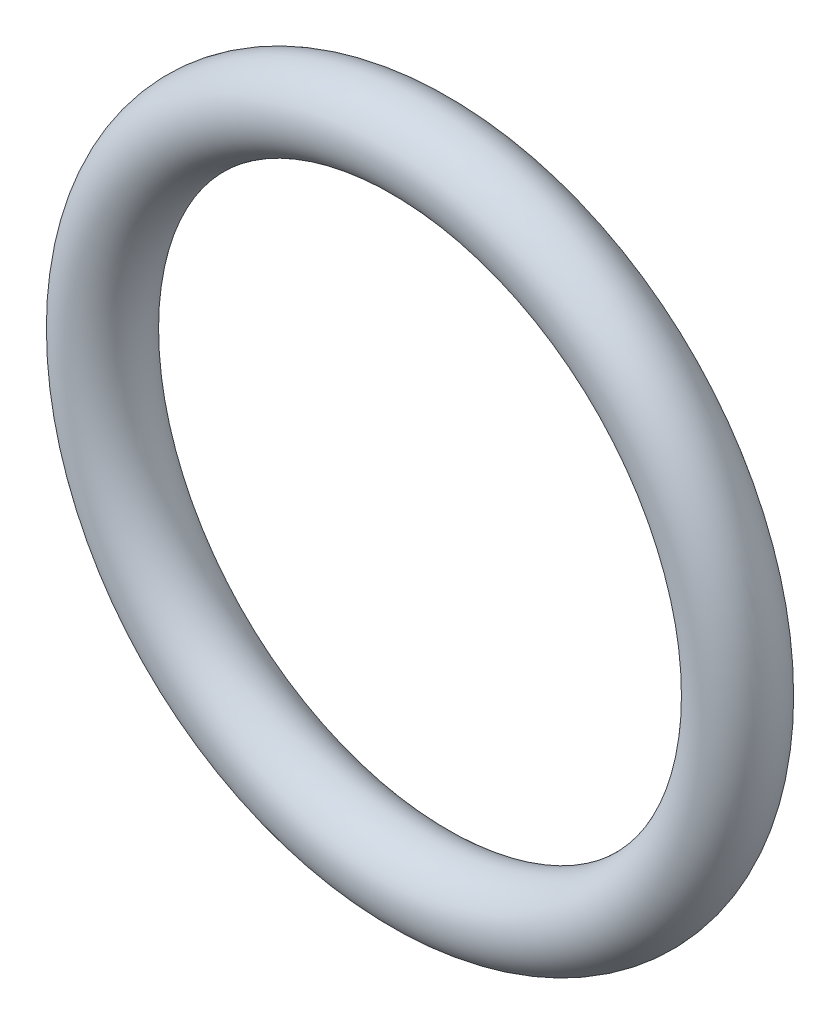
ISO-10303-21;
HEADER;
FILE_DESCRIPTION(('STEP AP214'),'2;1');
FILE_NAME('part.step','',(''),(''),'','','');
FILE_SCHEMA(('AUTOMOTIVE_DESIGN { 1 0 10303 214 1 1 1 1 }'));
ENDSEC;
DATA;
#1=APPLICATION_CONTEXT('core data for automotive mechanical design processes');
#2=APPLICATION_PROTOCOL_DEFINITION('international standard','automotive_design',2000,#1);
#3=PRODUCT_CONTEXT('',#1,'mechanical');
#4=PRODUCT('Part','Part','',(#3));
#5=PRODUCT_RELATED_PRODUCT_CATEGORY('part','',(#4));
#6=PRODUCT_DEFINITION_FORMATION('','',#4);
#7=PRODUCT_DEFINITION_CONTEXT('part definition',#1,'design');
#8=PRODUCT_DEFINITION('design','',#6,#7);
#9=PRODUCT_DEFINITION_SHAPE('','',#8);
#10=(LENGTH_UNIT() NAMED_UNIT(*) SI_UNIT(.MILLI.,.METRE.));
#11=(NAMED_UNIT(*) PLANE_ANGLE_UNIT() SI_UNIT($,.RADIAN.));
#12=(NAMED_UNIT(*) SI_UNIT($,.STERADIAN.) SOLID_ANGLE_UNIT());
#13=UNCERTAINTY_MEASURE_WITH_UNIT(LENGTH_MEASURE(1.E-05),#10,'distance_accuracy_value','');
#14=(GEOMETRIC_REPRESENTATION_CONTEXT(3) GLOBAL_UNCERTAINTY_ASSIGNED_CONTEXT((#13)) GLOBAL_UNIT_ASSIGNED_CONTEXT((#10,
#11,#12)) REPRESENTATION_CONTEXT('',''));
#15=CARTESIAN_POINT('',(0.,0.,0.));
#16=DIRECTION('',(0.,0.,1.));
#17=DIRECTION('',(1.,0.,0.));
#18=AXIS2_PLACEMENT_3D('',#15,#16,#17);
#19=CARTESIAN_POINT('',(0.,0.,0.));
#20=DIRECTION('',(0.,0.,1.));
#21=DIRECTION('',(1.,0.,0.));
#22=AXIS2_PLACEMENT_3D('',#19,#20,#21);
#23=TOROIDAL_SURFACE('',#22,4.,0.500000000000001);
#24=CARTESIAN_POINT('',(4.5,0.,0.));
#25=VERTEX_POINT('',#24);
#26=VERTEX_LOOP('',#25);
#27=FACE_BOUND('',#26,.T.);
#28=ADVANCED_FACE('F33',(#27),#23,.T.);
#29=CLOSED_SHELL('',(#28));
#30=MANIFOLD_SOLID_BREP('B2',#29);
#31=ADVANCED_BREP_SHAPE_REPRESENTATION('',(#18,#30),#14);
#32=SHAPE_DEFINITION_REPRESENTATION(#9,#31);
ENDSEC;
END-ISO-10303-21;
